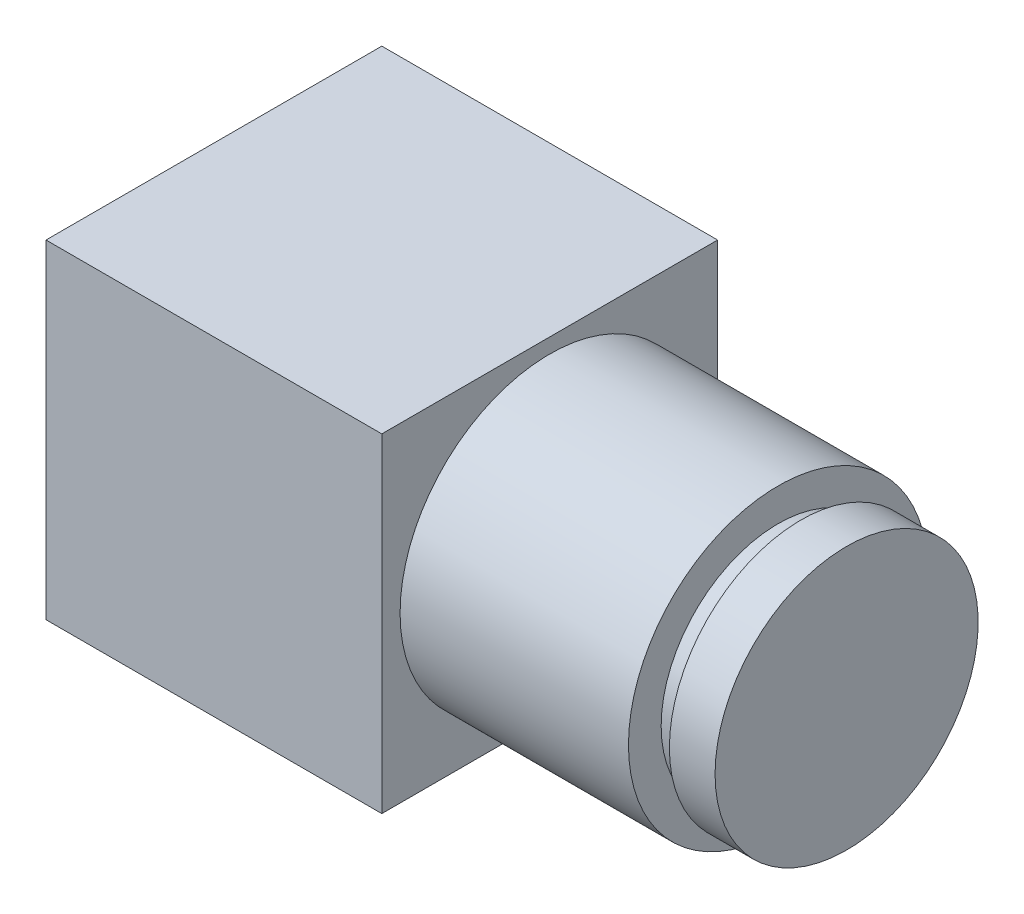
ISO-10303-21;
HEADER;
FILE_DESCRIPTION(('STEP AP214'),'2;1');
FILE_NAME('part.step','',(''),(''),'','','');
FILE_SCHEMA(('AUTOMOTIVE_DESIGN { 1 0 10303 214 1 1 1 1 }'));
ENDSEC;
DATA;
#1=APPLICATION_CONTEXT('core data for automotive mechanical design processes');
#2=APPLICATION_PROTOCOL_DEFINITION('international standard','automotive_design',2000,#1);
#3=PRODUCT_CONTEXT('',#1,'mechanical');
#4=PRODUCT('Part','Part','',(#3));
#5=PRODUCT_RELATED_PRODUCT_CATEGORY('part','',(#4));
#6=PRODUCT_DEFINITION_FORMATION('','',#4);
#7=PRODUCT_DEFINITION_CONTEXT('part definition',#1,'design');
#8=PRODUCT_DEFINITION('design','',#6,#7);
#9=PRODUCT_DEFINITION_SHAPE('','',#8);
#10=(LENGTH_UNIT() NAMED_UNIT(*) SI_UNIT(.MILLI.,.METRE.));
#11=(NAMED_UNIT(*) PLANE_ANGLE_UNIT() SI_UNIT($,.RADIAN.));
#12=(NAMED_UNIT(*) SI_UNIT($,.STERADIAN.) SOLID_ANGLE_UNIT());
#13=UNCERTAINTY_MEASURE_WITH_UNIT(LENGTH_MEASURE(1.E-05),#10,'distance_accuracy_value','');
#14=(GEOMETRIC_REPRESENTATION_CONTEXT(3) GLOBAL_UNCERTAINTY_ASSIGNED_CONTEXT((#13)) GLOBAL_UNIT_ASSIGNED_CONTEXT((#10,
#11,#12)) REPRESENTATION_CONTEXT('',''));
#15=CARTESIAN_POINT('',(0.,0.,0.));
#16=DIRECTION('',(0.,0.,1.));
#17=DIRECTION('',(1.,0.,0.));
#18=AXIS2_PLACEMENT_3D('',#15,#16,#17);
#19=CARTESIAN_POINT('',(19.6088,0.,0.));
#20=DIRECTION('',(1.,0.,0.));
#21=DIRECTION('',(0.,0.,-1.));
#22=AXIS2_PLACEMENT_3D('',#19,#20,#21);
#23=PLANE('',#22);
#24=CARTESIAN_POINT('',(19.6088,0.,0.));
#25=DIRECTION('',(1.,0.,0.));
#26=DIRECTION('',(0.,0.,-1.));
#27=AXIS2_PLACEMENT_3D('',#24,#25,#26);
#28=CIRCLE('',#27,5.20065);
#29=CARTESIAN_POINT('',(19.6088,0.,-5.20065));
#30=VERTEX_POINT('',#29);
#31=EDGE_CURVE('E421',#30,#30,#28,.T.);
#32=ORIENTED_EDGE('',*,*,#31,.T.);
#33=EDGE_LOOP('',(#32));
#34=FACE_BOUND('',#33,.T.);
#35=CARTESIAN_POINT('',(19.6088,0.,0.));
#36=DIRECTION('',(-1.,0.,0.));
#37=DIRECTION('',(0.,0.,1.));
#38=AXIS2_PLACEMENT_3D('',#35,#36,#37);
#39=CIRCLE('',#38,4.064);
#40=CARTESIAN_POINT('',(19.6088,0.,4.064));
#41=VERTEX_POINT('',#40);
#42=EDGE_CURVE('E424',#41,#41,#39,.T.);
#43=ORIENTED_EDGE('',*,*,#42,.T.);
#44=EDGE_LOOP('',(#43));
#45=FACE_BOUND('',#44,.T.);
#46=ADVANCED_FACE('F360',(#34,#45),#23,.T.);
#47=CARTESIAN_POINT('',(11.6713,5.715,5.83565));
#48=DIRECTION('',(-1.,0.,0.));
#49=DIRECTION('',(0.,0.,1.));
#50=AXIS2_PLACEMENT_3D('',#47,#48,#49);
#51=PLANE('',#50);
#52=DIRECTION('',(0.,0.,-1.));
#53=VECTOR('',#52,1.);
#54=CARTESIAN_POINT('',(11.6713,-5.715,5.83565));
#55=LINE('',#54,#53);
#56=CARTESIAN_POINT('',(11.6713,-5.715,5.83565));
#57=VERTEX_POINT('',#56);
#58=CARTESIAN_POINT('',(11.6713,-5.715,-5.83565));
#59=VERTEX_POINT('',#58);
#60=EDGE_CURVE('E409',#57,#59,#55,.T.);
#61=ORIENTED_EDGE('',*,*,#60,.T.);
#62=DIRECTION('',(0.,1.,0.));
#63=VECTOR('',#62,1.);
#64=CARTESIAN_POINT('',(11.6713,5.715,-5.83565));
#65=LINE('',#64,#63);
#66=CARTESIAN_POINT('',(11.6713,5.715,-5.83565));
#67=VERTEX_POINT('',#66);
#68=EDGE_CURVE('E418',#59,#67,#65,.T.);
#69=ORIENTED_EDGE('',*,*,#68,.T.);
#70=DIRECTION('',(0.,0.,-1.));
#71=VECTOR('',#70,1.);
#72=CARTESIAN_POINT('',(11.6713,5.715,5.83565));
#73=LINE('',#72,#71);
#74=CARTESIAN_POINT('',(11.6713,5.715,5.83565));
#75=VERTEX_POINT('',#74);
#76=EDGE_CURVE('E437',#75,#67,#73,.T.);
#77=ORIENTED_EDGE('',*,*,#76,.F.);
#78=DIRECTION('',(0.,1.,0.));
#79=VECTOR('',#78,1.);
#80=CARTESIAN_POINT('',(11.6713,5.715,5.83565));
#81=LINE('',#80,#79);
#82=EDGE_CURVE('E380',#57,#75,#81,.T.);
#83=ORIENTED_EDGE('',*,*,#82,.F.);
#84=EDGE_LOOP('',(#61,#69,#77,#83));
#85=FACE_BOUND('',#84,.T.);
#86=CARTESIAN_POINT('',(11.6713,0.,0.));
#87=DIRECTION('',(-1.,0.,0.));
#88=DIRECTION('',(0.,0.,1.));
#89=AXIS2_PLACEMENT_3D('',#86,#87,#88);
#90=CIRCLE('',#89,5.20065);
#91=CARTESIAN_POINT('',(11.6713,0.,5.20065));
#92=VERTEX_POINT('',#91);
#93=EDGE_CURVE('E11',#92,#92,#90,.F.);
#94=ORIENTED_EDGE('',*,*,#93,.F.);
#95=EDGE_LOOP('',(#94));
#96=FACE_BOUND('',#95,.T.);
#97=ADVANCED_FACE('F440',(#85,#96),#51,.F.);
#98=CARTESIAN_POINT('',(0.,5.715,5.83565));
#99=DIRECTION('',(1.,0.,0.));
#100=DIRECTION('',(0.,0.,-1.));
#101=AXIS2_PLACEMENT_3D('',#98,#99,#100);
#102=PLANE('',#101);
#103=DIRECTION('',(0.,0.,-1.));
#104=VECTOR('',#103,1.);
#105=CARTESIAN_POINT('',(0.,5.715,5.83565));
#106=LINE('',#105,#104);
#107=CARTESIAN_POINT('',(0.,5.715,5.83565));
#108=VERTEX_POINT('',#107);
#109=CARTESIAN_POINT('',(0.,5.715,-5.83565));
#110=VERTEX_POINT('',#109);
#111=EDGE_CURVE('E420',#108,#110,#106,.T.);
#112=ORIENTED_EDGE('',*,*,#111,.T.);
#113=DIRECTION('',(0.,-1.,0.));
#114=VECTOR('',#113,1.);
#115=CARTESIAN_POINT('',(0.,5.715,-5.83565));
#116=LINE('',#115,#114);
#117=CARTESIAN_POINT('',(0.,-5.715,-5.83565));
#118=VERTEX_POINT('',#117);
#119=EDGE_CURVE('E415',#110,#118,#116,.T.);
#120=ORIENTED_EDGE('',*,*,#119,.T.);
#121=DIRECTION('',(0.,0.,-1.));
#122=VECTOR('',#121,1.);
#123=CARTESIAN_POINT('',(0.,-5.715,5.83565));
#124=LINE('',#123,#122);
#125=CARTESIAN_POINT('',(0.,-5.715,5.83565));
#126=VERTEX_POINT('',#125);
#127=EDGE_CURVE('E368',#126,#118,#124,.T.);
#128=ORIENTED_EDGE('',*,*,#127,.F.);
#129=DIRECTION('',(0.,-1.,0.));
#130=VECTOR('',#129,1.);
#131=CARTESIAN_POINT('',(0.,5.715,5.83565));
#132=LINE('',#131,#130);
#133=EDGE_CURVE('E431',#108,#126,#132,.T.);
#134=ORIENTED_EDGE('',*,*,#133,.F.);
#135=EDGE_LOOP('',(#112,#120,#128,#134));
#136=FACE_BOUND('',#135,.T.);
#137=ADVANCED_FACE('F362',(#136),#102,.F.);
#138=CARTESIAN_POINT('',(0.,-5.715,5.83565));
#139=DIRECTION('',(0.,1.,0.));
#140=DIRECTION('',(-1.,0.,0.));
#141=AXIS2_PLACEMENT_3D('',#138,#139,#140);
#142=PLANE('',#141);
#143=ORIENTED_EDGE('',*,*,#127,.T.);
#144=DIRECTION('',(1.,0.,0.));
#145=VECTOR('',#144,1.);
#146=CARTESIAN_POINT('',(0.,-5.715,-5.83565));
#147=LINE('',#146,#145);
#148=EDGE_CURVE('E404',#118,#59,#147,.T.);
#149=ORIENTED_EDGE('',*,*,#148,.T.);
#150=ORIENTED_EDGE('',*,*,#60,.F.);
#151=DIRECTION('',(1.,0.,0.));
#152=VECTOR('',#151,1.);
#153=CARTESIAN_POINT('',(0.,-5.715,5.83565));
#154=LINE('',#153,#152);
#155=EDGE_CURVE('E405',#126,#57,#154,.T.);
#156=ORIENTED_EDGE('',*,*,#155,.F.);
#157=EDGE_LOOP('',(#143,#149,#150,#156));
#158=FACE_BOUND('',#157,.T.);
#159=ADVANCED_FACE('F402',(#158),#142,.F.);
#160=CARTESIAN_POINT('',(0.,5.715,5.83565));
#161=DIRECTION('',(0.,-1.,0.));
#162=DIRECTION('',(1.,0.,0.));
#163=AXIS2_PLACEMENT_3D('',#160,#161,#162);
#164=PLANE('',#163);
#165=ORIENTED_EDGE('',*,*,#76,.T.);
#166=DIRECTION('',(-1.,0.,0.));
#167=VECTOR('',#166,1.);
#168=CARTESIAN_POINT('',(0.,5.715,-5.83565));
#169=LINE('',#168,#167);
#170=EDGE_CURVE('E429',#67,#110,#169,.T.);
#171=ORIENTED_EDGE('',*,*,#170,.T.);
#172=ORIENTED_EDGE('',*,*,#111,.F.);
#173=DIRECTION('',(-1.,0.,0.));
#174=VECTOR('',#173,1.);
#175=CARTESIAN_POINT('',(0.,5.715,5.83565));
#176=LINE('',#175,#174);
#177=EDGE_CURVE('E375',#75,#108,#176,.T.);
#178=ORIENTED_EDGE('',*,*,#177,.F.);
#179=EDGE_LOOP('',(#165,#171,#172,#178));
#180=FACE_BOUND('',#179,.T.);
#181=ADVANCED_FACE('F443',(#180),#164,.F.);
#182=CARTESIAN_POINT('',(0.,-5.715,5.83565));
#183=DIRECTION('',(0.,0.,1.));
#184=DIRECTION('',(1.,0.,0.));
#185=AXIS2_PLACEMENT_3D('',#182,#183,#184);
#186=PLANE('',#185);
#187=ORIENTED_EDGE('',*,*,#133,.T.);
#188=ORIENTED_EDGE('',*,*,#155,.T.);
#189=ORIENTED_EDGE('',*,*,#82,.T.);
#190=ORIENTED_EDGE('',*,*,#177,.T.);
#191=EDGE_LOOP('',(#187,#188,#189,#190));
#192=FACE_BOUND('',#191,.T.);
#193=ADVANCED_FACE('F444',(#192),#186,.T.);
#194=CARTESIAN_POINT('',(0.,-5.715,-5.83565));
#195=DIRECTION('',(0.,0.,1.));
#196=DIRECTION('',(1.,0.,0.));
#197=AXIS2_PLACEMENT_3D('',#194,#195,#196);
#198=PLANE('',#197);
#199=ORIENTED_EDGE('',*,*,#119,.F.);
#200=ORIENTED_EDGE('',*,*,#170,.F.);
#201=ORIENTED_EDGE('',*,*,#68,.F.);
#202=ORIENTED_EDGE('',*,*,#148,.F.);
#203=EDGE_LOOP('',(#199,#200,#201,#202));
#204=FACE_BOUND('',#203,.T.);
#205=ADVANCED_FACE('F413',(#204),#198,.F.);
#206=CARTESIAN_POINT('',(19.6088,0.,0.));
#207=DIRECTION('',(-1.,0.,0.));
#208=DIRECTION('',(0.,0.,1.));
#209=AXIS2_PLACEMENT_3D('',#206,#207,#208);
#210=CYLINDRICAL_SURFACE('',#209,5.20065);
#211=ORIENTED_EDGE('',*,*,#31,.F.);
#212=EDGE_LOOP('',(#211));
#213=FACE_BOUND('',#212,.T.);
#214=ORIENTED_EDGE('',*,*,#93,.T.);
#215=EDGE_LOOP('',(#214));
#216=FACE_BOUND('',#215,.T.);
#217=ADVANCED_FACE('F451',(#213,#216),#210,.T.);
#218=CARTESIAN_POINT('',(0.,0.,0.));
#219=DIRECTION('',(-1.,0.,0.));
#220=DIRECTION('',(0.,0.,1.));
#221=AXIS2_PLACEMENT_3D('',#218,#219,#220);
#222=CYLINDRICAL_SURFACE('',#221,4.064);
#223=ORIENTED_EDGE('',*,*,#42,.F.);
#224=EDGE_LOOP('',(#223));
#225=FACE_BOUND('',#224,.T.);
#226=CARTESIAN_POINT('',(20.40255,0.,0.));
#227=DIRECTION('',(-1.,0.,0.));
#228=DIRECTION('',(0.,0.,1.));
#229=AXIS2_PLACEMENT_3D('',#226,#227,#228);
#230=CIRCLE('',#229,4.064);
#231=CARTESIAN_POINT('',(20.40255,0.,4.064));
#232=VERTEX_POINT('',#231);
#233=EDGE_CURVE('E486',#232,#232,#230,.T.);
#234=ORIENTED_EDGE('',*,*,#233,.T.);
#235=EDGE_LOOP('',(#234));
#236=FACE_BOUND('',#235,.T.);
#237=ADVANCED_FACE('F466',(#225,#236),#222,.T.);
#238=CARTESIAN_POINT('',(21.99005,4.572,0.));
#239=DIRECTION('',(-1.,0.,0.));
#240=DIRECTION('',(0.,0.,1.));
#241=AXIS2_PLACEMENT_3D('',#238,#239,#240);
#242=PLANE('',#241);
#243=CARTESIAN_POINT('',(21.99005,0.,0.));
#244=DIRECTION('',(-1.,0.,0.));
#245=DIRECTION('',(0.,0.,1.));
#246=AXIS2_PLACEMENT_3D('',#243,#244,#245);
#247=CIRCLE('',#246,4.572);
#248=CARTESIAN_POINT('',(21.99005,0.,4.572));
#249=VERTEX_POINT('',#248);
#250=EDGE_CURVE('E491',#249,#249,#247,.T.);
#251=ORIENTED_EDGE('',*,*,#250,.F.);
#252=EDGE_LOOP('',(#251));
#253=FACE_BOUND('',#252,.T.);
#254=ADVANCED_FACE('F471',(#253),#242,.F.);
#255=CARTESIAN_POINT('',(0.,0.,0.));
#256=DIRECTION('',(-1.,0.,0.));
#257=DIRECTION('',(0.,0.,1.));
#258=AXIS2_PLACEMENT_3D('',#255,#256,#257);
#259=CYLINDRICAL_SURFACE('',#258,4.572);
#260=CARTESIAN_POINT('',(20.40255,0.,0.));
#261=DIRECTION('',(-1.,0.,0.));
#262=DIRECTION('',(0.,0.,1.));
#263=AXIS2_PLACEMENT_3D('',#260,#261,#262);
#264=CIRCLE('',#263,4.572);
#265=CARTESIAN_POINT('',(20.40255,0.,4.572));
#266=VERTEX_POINT('',#265);
#267=EDGE_CURVE('E488',#266,#266,#264,.T.);
#268=ORIENTED_EDGE('',*,*,#267,.F.);
#269=EDGE_LOOP('',(#268));
#270=FACE_BOUND('',#269,.T.);
#271=ORIENTED_EDGE('',*,*,#250,.T.);
#272=EDGE_LOOP('',(#271));
#273=FACE_BOUND('',#272,.T.);
#274=ADVANCED_FACE('F479',(#270,#273),#259,.T.);
#275=CARTESIAN_POINT('',(20.40255,4.064,0.));
#276=DIRECTION('',(1.,0.,0.));
#277=DIRECTION('',(0.,0.,-1.));
#278=AXIS2_PLACEMENT_3D('',#275,#276,#277);
#279=PLANE('',#278);
#280=ORIENTED_EDGE('',*,*,#233,.F.);
#281=EDGE_LOOP('',(#280));
#282=FACE_BOUND('',#281,.T.);
#283=ORIENTED_EDGE('',*,*,#267,.T.);
#284=EDGE_LOOP('',(#283));
#285=FACE_BOUND('',#284,.T.);
#286=ADVANCED_FACE('F498',(#282,#285),#279,.F.);
#287=CLOSED_SHELL('',(#46,#97,#137,#159,#181,#193,#205,#217,#237,#254,#274,#286));
#288=MANIFOLD_SOLID_BREP('B2',#287);
#289=ADVANCED_BREP_SHAPE_REPRESENTATION('',(#18,#288),#14);
#290=SHAPE_DEFINITION_REPRESENTATION(#9,#289);
ENDSEC;
END-ISO-10303-21;
